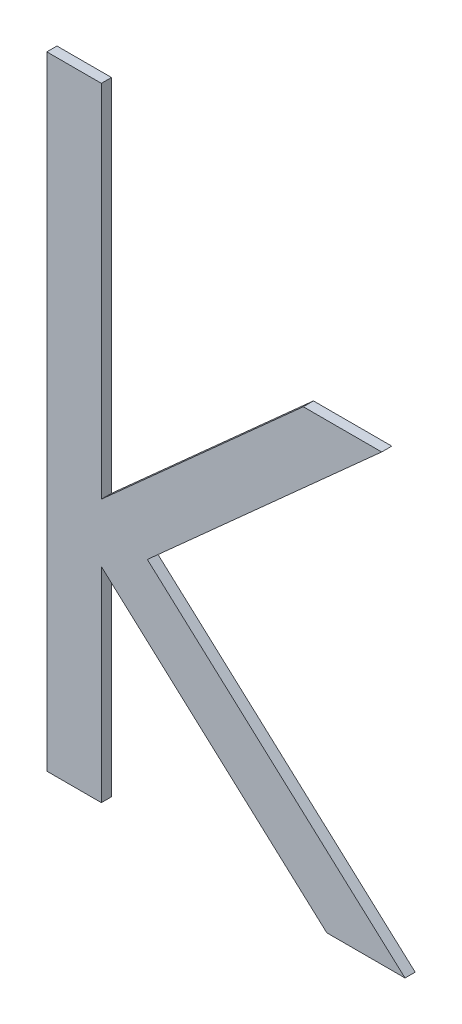
ISO-10303-21;
HEADER;
FILE_DESCRIPTION(('STEP AP214'),'2;1');
FILE_NAME('part.step','',(''),(''),'','','');
FILE_SCHEMA(('AUTOMOTIVE_DESIGN { 1 0 10303 214 1 1 1 1 }'));
ENDSEC;
DATA;
#1=APPLICATION_CONTEXT('core data for automotive mechanical design processes');
#2=APPLICATION_PROTOCOL_DEFINITION('international standard','automotive_design',2000,#1);
#3=PRODUCT_CONTEXT('',#1,'mechanical');
#4=PRODUCT('Part','Part','',(#3));
#5=PRODUCT_RELATED_PRODUCT_CATEGORY('part','',(#4));
#6=PRODUCT_DEFINITION_FORMATION('','',#4);
#7=PRODUCT_DEFINITION_CONTEXT('part definition',#1,'design');
#8=PRODUCT_DEFINITION('design','',#6,#7);
#9=PRODUCT_DEFINITION_SHAPE('','',#8);
#10=(LENGTH_UNIT() NAMED_UNIT(*) SI_UNIT(.MILLI.,.METRE.));
#11=(NAMED_UNIT(*) PLANE_ANGLE_UNIT() SI_UNIT($,.RADIAN.));
#12=(NAMED_UNIT(*) SI_UNIT($,.STERADIAN.) SOLID_ANGLE_UNIT());
#13=UNCERTAINTY_MEASURE_WITH_UNIT(LENGTH_MEASURE(1.E-05),#10,'distance_accuracy_value','');
#14=(GEOMETRIC_REPRESENTATION_CONTEXT(3) GLOBAL_UNCERTAINTY_ASSIGNED_CONTEXT((#13)) GLOBAL_UNIT_ASSIGNED_CONTEXT((#10,
#11,#12)) REPRESENTATION_CONTEXT('',''));
#15=CARTESIAN_POINT('',(0.,0.,0.));
#16=DIRECTION('',(0.,0.,1.));
#17=DIRECTION('',(1.,0.,0.));
#18=AXIS2_PLACEMENT_3D('',#15,#16,#17);
#19=CARTESIAN_POINT('',(0.539825518952301,1.00888395616039,0.551));
#20=DIRECTION('',(-1.,0.,0.));
#21=DIRECTION('',(0.,0.,1.));
#22=AXIS2_PLACEMENT_3D('',#19,#20,#21);
#23=PLANE('',#22);
#24=DIRECTION('',(0.,1.,0.));
#25=VECTOR('',#24,1.);
#26=CARTESIAN_POINT('',(0.539825518952301,1.00888395616039,0.55));
#27=LINE('',#26,#25);
#28=CARTESIAN_POINT('',(0.539825518952301,1.00888395616039,0.55));
#29=VERTEX_POINT('',#28);
#30=CARTESIAN_POINT('',(0.539825518952301,1.07042241769885,0.55));
#31=VERTEX_POINT('',#30);
#32=EDGE_CURVE('E11',#29,#31,#27,.T.);
#33=ORIENTED_EDGE('',*,*,#32,.F.);
#34=DIRECTION('',(0.,0.,-1.));
#35=VECTOR('',#34,1.);
#36=CARTESIAN_POINT('',(0.539825518952301,1.00888395616039,0.551));
#37=LINE('',#36,#35);
#38=CARTESIAN_POINT('',(0.539825518952301,1.00888395616039,0.551));
#39=VERTEX_POINT('',#38);
#40=EDGE_CURVE('E194',#39,#29,#37,.T.);
#41=ORIENTED_EDGE('',*,*,#40,.F.);
#42=DIRECTION('',(0.,1.,0.));
#43=VECTOR('',#42,1.);
#44=CARTESIAN_POINT('',(0.539825518952301,1.00888395616039,0.551));
#45=LINE('',#44,#43);
#46=CARTESIAN_POINT('',(0.539825518952301,1.07042241769885,0.551));
#47=VERTEX_POINT('',#46);
#48=EDGE_CURVE('E187',#39,#47,#45,.T.);
#49=ORIENTED_EDGE('',*,*,#48,.T.);
#50=DIRECTION('',(0.,-2.22044604925006E-13,-1.));
#51=VECTOR('',#50,1.);
#52=CARTESIAN_POINT('',(0.539825518952301,1.07042241769885,0.551));
#53=LINE('',#52,#51);
#54=EDGE_CURVE('E115',#47,#31,#53,.T.);
#55=ORIENTED_EDGE('',*,*,#54,.T.);
#56=EDGE_LOOP('',(#33,#41,#49,#55));
#57=FACE_BOUND('',#56,.T.);
#58=ADVANCED_FACE('F17',(#57),#23,.T.);
#59=CARTESIAN_POINT('',(0.545210134336916,1.00888395616039,0.551));
#60=DIRECTION('',(0.,-1.,0.));
#61=DIRECTION('',(0.,0.,-1.));
#62=AXIS2_PLACEMENT_3D('',#59,#60,#61);
#63=PLANE('',#62);
#64=DIRECTION('',(-1.,0.,0.));
#65=VECTOR('',#64,1.);
#66=CARTESIAN_POINT('',(0.545210134336916,1.00888395616039,0.55));
#67=LINE('',#66,#65);
#68=CARTESIAN_POINT('',(0.545210134336916,1.00888395616039,0.55));
#69=VERTEX_POINT('',#68);
#70=EDGE_CURVE('E24',#69,#29,#67,.T.);
#71=ORIENTED_EDGE('',*,*,#70,.F.);
#72=DIRECTION('',(0.,0.,-1.));
#73=VECTOR('',#72,1.);
#74=CARTESIAN_POINT('',(0.545210134336916,1.00888395616039,0.551));
#75=LINE('',#74,#73);
#76=CARTESIAN_POINT('',(0.545210134336916,1.00888395616039,0.551));
#77=VERTEX_POINT('',#76);
#78=EDGE_CURVE('E189',#77,#69,#75,.T.);
#79=ORIENTED_EDGE('',*,*,#78,.F.);
#80=DIRECTION('',(-1.,0.,0.));
#81=VECTOR('',#80,1.);
#82=CARTESIAN_POINT('',(0.545210134336916,1.00888395616039,0.551));
#83=LINE('',#82,#81);
#84=EDGE_CURVE('E178',#77,#39,#83,.T.);
#85=ORIENTED_EDGE('',*,*,#84,.T.);
#86=ORIENTED_EDGE('',*,*,#40,.T.);
#87=EDGE_LOOP('',(#71,#79,#85,#86));
#88=FACE_BOUND('',#87,.T.);
#89=ADVANCED_FACE('F205',(#88),#63,.T.);
#90=CARTESIAN_POINT('',(0.545210134336916,1.02908828308347,0.551));
#91=DIRECTION('',(1.,0.,0.));
#92=DIRECTION('',(0.,0.,-1.));
#93=AXIS2_PLACEMENT_3D('',#90,#91,#92);
#94=PLANE('',#93);
#95=DIRECTION('',(0.,-1.,0.));
#96=VECTOR('',#95,1.);
#97=CARTESIAN_POINT('',(0.545210134336916,1.02908828308347,0.55));
#98=LINE('',#97,#96);
#99=CARTESIAN_POINT('',(0.545210134336916,1.02908828308347,0.55));
#100=VERTEX_POINT('',#99);
#101=EDGE_CURVE('E191',#100,#69,#98,.T.);
#102=ORIENTED_EDGE('',*,*,#101,.F.);
#103=DIRECTION('',(0.,0.,-1.));
#104=VECTOR('',#103,1.);
#105=CARTESIAN_POINT('',(0.545210134336916,1.02908828308347,0.551));
#106=LINE('',#105,#104);
#107=CARTESIAN_POINT('',(0.545210134336916,1.02908828308347,0.551));
#108=VERTEX_POINT('',#107);
#109=EDGE_CURVE('E181',#108,#100,#106,.T.);
#110=ORIENTED_EDGE('',*,*,#109,.F.);
#111=DIRECTION('',(0.,-1.,0.));
#112=VECTOR('',#111,1.);
#113=CARTESIAN_POINT('',(0.545210134336916,1.02908828308347,0.551));
#114=LINE('',#113,#112);
#115=EDGE_CURVE('E168',#108,#77,#114,.T.);
#116=ORIENTED_EDGE('',*,*,#115,.T.);
#117=ORIENTED_EDGE('',*,*,#78,.T.);
#118=EDGE_LOOP('',(#102,#110,#116,#117));
#119=FACE_BOUND('',#118,.T.);
#120=ADVANCED_FACE('F198',(#119),#94,.T.);
#121=CARTESIAN_POINT('',(0.567481768952301,1.00888395616039,0.551));
#122=DIRECTION('',(-0.671896534985391,-0.740645020421137,0.));
#123=DIRECTION('',(0.740645020421137,-0.67189653498539,0.));
#124=AXIS2_PLACEMENT_3D('',#121,#122,#123);
#125=PLANE('',#124);
#126=DIRECTION('',(-0.740645020421134,0.671896534985394,0.));
#127=VECTOR('',#126,1.);
#128=CARTESIAN_POINT('',(0.567481768952301,1.00888395616039,0.55));
#129=LINE('',#128,#127);
#130=CARTESIAN_POINT('',(0.567481768952301,1.00888395616039,0.55));
#131=VERTEX_POINT('',#130);
#132=EDGE_CURVE('E184',#131,#100,#129,.T.);
#133=ORIENTED_EDGE('',*,*,#132,.F.);
#134=DIRECTION('',(-1.11022302462503E-13,0.,-1.));
#135=VECTOR('',#134,1.);
#136=CARTESIAN_POINT('',(0.567481768952301,1.00888395616039,0.551));
#137=LINE('',#136,#135);
#138=CARTESIAN_POINT('',(0.567481768952301,1.00888395616039,0.551));
#139=VERTEX_POINT('',#138);
#140=EDGE_CURVE('E171',#139,#131,#137,.T.);
#141=ORIENTED_EDGE('',*,*,#140,.F.);
#142=DIRECTION('',(-0.740645020421134,0.671896534985394,0.));
#143=VECTOR('',#142,1.);
#144=CARTESIAN_POINT('',(0.567481768952301,1.00888395616039,0.551));
#145=LINE('',#144,#143);
#146=EDGE_CURVE('E159',#139,#108,#145,.T.);
#147=ORIENTED_EDGE('',*,*,#146,.T.);
#148=ORIENTED_EDGE('',*,*,#109,.T.);
#149=EDGE_LOOP('',(#133,#141,#147,#148));
#150=FACE_BOUND('',#149,.T.);
#151=ADVANCED_FACE('F200',(#150),#125,.T.);
#152=CARTESIAN_POINT('',(0.575210134336916,1.00888395616039,0.551));
#153=DIRECTION('',(0.,-1.,0.));
#154=DIRECTION('',(0.,0.,-1.));
#155=AXIS2_PLACEMENT_3D('',#152,#153,#154);
#156=PLANE('',#155);
#157=DIRECTION('',(-1.,0.,0.));
#158=VECTOR('',#157,1.);
#159=CARTESIAN_POINT('',(0.575210134336916,1.00888395616039,0.55));
#160=LINE('',#159,#158);
#161=CARTESIAN_POINT('',(0.575210134336916,1.00888395616039,0.55));
#162=VERTEX_POINT('',#161);
#163=EDGE_CURVE('E174',#162,#131,#160,.T.);
#164=ORIENTED_EDGE('',*,*,#163,.F.);
#165=DIRECTION('',(0.,0.,-1.));
#166=VECTOR('',#165,1.);
#167=CARTESIAN_POINT('',(0.575210134336916,1.00888395616039,0.551));
#168=LINE('',#167,#166);
#169=CARTESIAN_POINT('',(0.575210134336916,1.00888395616039,0.551));
#170=VERTEX_POINT('',#169);
#171=EDGE_CURVE('E162',#170,#162,#168,.T.);
#172=ORIENTED_EDGE('',*,*,#171,.F.);
#173=DIRECTION('',(-1.,0.,0.));
#174=VECTOR('',#173,1.);
#175=CARTESIAN_POINT('',(0.575210134336916,1.00888395616039,0.551));
#176=LINE('',#175,#174);
#177=EDGE_CURVE('E150',#170,#139,#176,.T.);
#178=ORIENTED_EDGE('',*,*,#177,.T.);
#179=ORIENTED_EDGE('',*,*,#140,.T.);
#180=EDGE_LOOP('',(#164,#172,#178,#179));
#181=FACE_BOUND('',#180,.T.);
#182=ADVANCED_FACE('F217',(#181),#156,.T.);
#183=CARTESIAN_POINT('',(0.549753403567686,1.03196087923731,0.551));
#184=DIRECTION('',(0.671627454189112,0.740889035402369,0.));
#185=DIRECTION('',(-0.740889035402369,0.671627454189112,0.));
#186=AXIS2_PLACEMENT_3D('',#183,#184,#185);
#187=PLANE('',#186);
#188=DIRECTION('',(0.740889035402369,-0.671627454189112,0.));
#189=VECTOR('',#188,1.);
#190=CARTESIAN_POINT('',(0.549753403567686,1.03196087923731,0.55));
#191=LINE('',#190,#189);
#192=CARTESIAN_POINT('',(0.549753403567686,1.03196087923731,0.55));
#193=VERTEX_POINT('',#192);
#194=EDGE_CURVE('E165',#193,#162,#191,.T.);
#195=ORIENTED_EDGE('',*,*,#194,.F.);
#196=DIRECTION('',(0.,0.,-1.));
#197=VECTOR('',#196,1.);
#198=CARTESIAN_POINT('',(0.549753403567686,1.03196087923731,0.551));
#199=LINE('',#198,#197);
#200=CARTESIAN_POINT('',(0.549753403567686,1.03196087923731,0.551));
#201=VERTEX_POINT('',#200);
#202=EDGE_CURVE('E153',#201,#193,#199,.T.);
#203=ORIENTED_EDGE('',*,*,#202,.F.);
#204=DIRECTION('',(0.740889035402369,-0.671627454189112,0.));
#205=VECTOR('',#204,1.);
#206=CARTESIAN_POINT('',(0.549753403567686,1.03196087923731,0.551));
#207=LINE('',#206,#205);
#208=EDGE_CURVE('E141',#201,#170,#207,.T.);
#209=ORIENTED_EDGE('',*,*,#208,.T.);
#210=ORIENTED_EDGE('',*,*,#171,.T.);
#211=EDGE_LOOP('',(#195,#203,#209,#210));
#212=FACE_BOUND('',#211,.T.);
#213=ADVANCED_FACE('F215',(#212),#187,.T.);
#214=CARTESIAN_POINT('',(0.572902442029224,1.05273011000654,0.551));
#215=DIRECTION('',(0.667810938297981,-0.744330941644622,0.));
#216=DIRECTION('',(0.744330941644622,0.667810938297981,0.));
#217=AXIS2_PLACEMENT_3D('',#214,#215,#216);
#218=PLANE('',#217);
#219=DIRECTION('',(-0.744330941644626,-0.667810938297977,0.));
#220=VECTOR('',#219,1.);
#221=CARTESIAN_POINT('',(0.572902442029224,1.05273011000654,0.55));
#222=LINE('',#221,#220);
#223=CARTESIAN_POINT('',(0.572902442029224,1.05273011000654,0.55));
#224=VERTEX_POINT('',#223);
#225=EDGE_CURVE('E156',#224,#193,#222,.T.);
#226=ORIENTED_EDGE('',*,*,#225,.F.);
#227=DIRECTION('',(0.,0.,-1.));
#228=VECTOR('',#227,1.);
#229=CARTESIAN_POINT('',(0.572902442029224,1.05273011000654,0.551));
#230=LINE('',#229,#228);
#231=CARTESIAN_POINT('',(0.572902442029224,1.05273011000654,0.551));
#232=VERTEX_POINT('',#231);
#233=EDGE_CURVE('E144',#232,#224,#230,.T.);
#234=ORIENTED_EDGE('',*,*,#233,.F.);
#235=DIRECTION('',(-0.744330941644626,-0.667810938297977,0.));
#236=VECTOR('',#235,1.);
#237=CARTESIAN_POINT('',(0.572902442029224,1.05273011000654,0.551));
#238=LINE('',#237,#236);
#239=EDGE_CURVE('E132',#232,#201,#238,.T.);
#240=ORIENTED_EDGE('',*,*,#239,.T.);
#241=ORIENTED_EDGE('',*,*,#202,.T.);
#242=EDGE_LOOP('',(#226,#234,#240,#241));
#243=FACE_BOUND('',#242,.T.);
#244=ADVANCED_FACE('F212',(#243),#218,.T.);
#245=CARTESIAN_POINT('',(0.565162057413839,1.05273011000654,0.551));
#246=DIRECTION('',(0.,1.,0.));
#247=DIRECTION('',(0.,0.,1.));
#248=AXIS2_PLACEMENT_3D('',#245,#246,#247);
#249=PLANE('',#248);
#250=DIRECTION('',(1.,0.,0.));
#251=VECTOR('',#250,1.);
#252=CARTESIAN_POINT('',(0.565162057413839,1.05273011000654,0.55));
#253=LINE('',#252,#251);
#254=CARTESIAN_POINT('',(0.565162057413839,1.05273011000654,0.55));
#255=VERTEX_POINT('',#254);
#256=EDGE_CURVE('E147',#255,#224,#253,.T.);
#257=ORIENTED_EDGE('',*,*,#256,.F.);
#258=DIRECTION('',(0.,0.,-1.));
#259=VECTOR('',#258,1.);
#260=CARTESIAN_POINT('',(0.565162057413839,1.05273011000654,0.551));
#261=LINE('',#260,#259);
#262=CARTESIAN_POINT('',(0.565162057413839,1.05273011000654,0.551));
#263=VERTEX_POINT('',#262);
#264=EDGE_CURVE('E135',#263,#255,#261,.T.);
#265=ORIENTED_EDGE('',*,*,#264,.F.);
#266=DIRECTION('',(1.,0.,0.));
#267=VECTOR('',#266,1.);
#268=CARTESIAN_POINT('',(0.565162057413839,1.05273011000654,0.551));
#269=LINE('',#268,#267);
#270=EDGE_CURVE('E126',#263,#232,#269,.T.);
#271=ORIENTED_EDGE('',*,*,#270,.T.);
#272=ORIENTED_EDGE('',*,*,#233,.T.);
#273=EDGE_LOOP('',(#257,#265,#271,#272));
#274=FACE_BOUND('',#273,.T.);
#275=ADVANCED_FACE('F209',(#274),#249,.T.);
#276=CARTESIAN_POINT('',(0.545210134336916,1.03484549462193,0.551));
#277=DIRECTION('',(-0.667476411136923,0.744630942531784,0.));
#278=DIRECTION('',(-0.744630942531784,-0.667476411136923,0.));
#279=AXIS2_PLACEMENT_3D('',#276,#277,#278);
#280=PLANE('',#279);
#281=DIRECTION('',(0.744630942531781,0.667476411136927,0.));
#282=VECTOR('',#281,1.);
#283=CARTESIAN_POINT('',(0.545210134336916,1.03484549462193,0.55));
#284=LINE('',#283,#282);
#285=CARTESIAN_POINT('',(0.545210134336916,1.03484549462193,0.55));
#286=VERTEX_POINT('',#285);
#287=EDGE_CURVE('E138',#286,#255,#284,.T.);
#288=ORIENTED_EDGE('',*,*,#287,.F.);
#289=DIRECTION('',(0.,0.,-1.));
#290=VECTOR('',#289,1.);
#291=CARTESIAN_POINT('',(0.545210134336916,1.03484549462193,0.551));
#292=LINE('',#291,#290);
#293=CARTESIAN_POINT('',(0.545210134336916,1.03484549462193,0.551));
#294=VERTEX_POINT('',#293);
#295=EDGE_CURVE('E129',#294,#286,#292,.T.);
#296=ORIENTED_EDGE('',*,*,#295,.F.);
#297=DIRECTION('',(0.744630942531781,0.667476411136927,0.));
#298=VECTOR('',#297,1.);
#299=CARTESIAN_POINT('',(0.545210134336916,1.03484549462193,0.551));
#300=LINE('',#299,#298);
#301=EDGE_CURVE('E109',#294,#263,#300,.T.);
#302=ORIENTED_EDGE('',*,*,#301,.T.);
#303=ORIENTED_EDGE('',*,*,#264,.T.);
#304=EDGE_LOOP('',(#288,#296,#302,#303));
#305=FACE_BOUND('',#304,.T.);
#306=ADVANCED_FACE('F207',(#305),#280,.T.);
#307=CARTESIAN_POINT('',(0.545210134336916,1.07042241769885,0.551));
#308=DIRECTION('',(1.,0.,0.));
#309=DIRECTION('',(0.,0.,-1.));
#310=AXIS2_PLACEMENT_3D('',#307,#308,#309);
#311=PLANE('',#310);
#312=DIRECTION('',(0.,-1.,0.));
#313=VECTOR('',#312,1.);
#314=CARTESIAN_POINT('',(0.545210134336916,1.07042241769885,0.55));
#315=LINE('',#314,#313);
#316=CARTESIAN_POINT('',(0.545210134336916,1.07042241769885,0.55));
#317=VERTEX_POINT('',#316);
#318=EDGE_CURVE('E104',#317,#286,#315,.T.);
#319=ORIENTED_EDGE('',*,*,#318,.F.);
#320=DIRECTION('',(0.,-2.22044604925006E-13,-1.));
#321=VECTOR('',#320,1.);
#322=CARTESIAN_POINT('',(0.545210134336916,1.07042241769885,0.551));
#323=LINE('',#322,#321);
#324=CARTESIAN_POINT('',(0.545210134336916,1.07042241769885,0.551));
#325=VERTEX_POINT('',#324);
#326=EDGE_CURVE('E96',#325,#317,#323,.T.);
#327=ORIENTED_EDGE('',*,*,#326,.F.);
#328=DIRECTION('',(0.,-1.,0.));
#329=VECTOR('',#328,1.);
#330=CARTESIAN_POINT('',(0.545210134336916,1.07042241769885,0.551));
#331=LINE('',#330,#329);
#332=EDGE_CURVE('E101',#325,#294,#331,.T.);
#333=ORIENTED_EDGE('',*,*,#332,.T.);
#334=ORIENTED_EDGE('',*,*,#295,.T.);
#335=EDGE_LOOP('',(#319,#327,#333,#334));
#336=FACE_BOUND('',#335,.T.);
#337=ADVANCED_FACE('F98',(#336),#311,.T.);
#338=CARTESIAN_POINT('',(0.539825518952301,1.07042241769885,0.551));
#339=DIRECTION('',(0.,1.,0.));
#340=DIRECTION('',(0.,0.,1.));
#341=AXIS2_PLACEMENT_3D('',#338,#339,#340);
#342=PLANE('',#341);
#343=DIRECTION('',(1.,0.,0.));
#344=VECTOR('',#343,1.);
#345=CARTESIAN_POINT('',(0.539825518952301,1.07042241769885,0.55));
#346=LINE('',#345,#344);
#347=EDGE_CURVE('E108',#31,#317,#346,.T.);
#348=ORIENTED_EDGE('',*,*,#347,.F.);
#349=ORIENTED_EDGE('',*,*,#54,.F.);
#350=DIRECTION('',(1.,0.,0.));
#351=VECTOR('',#350,1.);
#352=CARTESIAN_POINT('',(0.539825518952301,1.07042241769885,0.551));
#353=LINE('',#352,#351);
#354=EDGE_CURVE('E113',#47,#325,#353,.T.);
#355=ORIENTED_EDGE('',*,*,#354,.T.);
#356=ORIENTED_EDGE('',*,*,#326,.T.);
#357=EDGE_LOOP('',(#348,#349,#355,#356));
#358=FACE_BOUND('',#357,.T.);
#359=ADVANCED_FACE('F114',(#358),#342,.T.);
#360=CARTESIAN_POINT('',(0.,0.,0.551));
#361=DIRECTION('',(0.,0.,-1.));
#362=DIRECTION('',(-1.,0.,0.));
#363=AXIS2_PLACEMENT_3D('',#360,#361,#362);
#364=PLANE('',#363);
#365=ORIENTED_EDGE('',*,*,#48,.F.);
#366=ORIENTED_EDGE('',*,*,#84,.F.);
#367=ORIENTED_EDGE('',*,*,#115,.F.);
#368=ORIENTED_EDGE('',*,*,#146,.F.);
#369=ORIENTED_EDGE('',*,*,#177,.F.);
#370=ORIENTED_EDGE('',*,*,#208,.F.);
#371=ORIENTED_EDGE('',*,*,#239,.F.);
#372=ORIENTED_EDGE('',*,*,#270,.F.);
#373=ORIENTED_EDGE('',*,*,#301,.F.);
#374=ORIENTED_EDGE('',*,*,#332,.F.);
#375=ORIENTED_EDGE('',*,*,#354,.F.);
#376=EDGE_LOOP('',(#365,#366,#367,#368,#369,#370,#371,#372,#373,#374,#375));
#377=FACE_BOUND('',#376,.T.);
#378=ADVANCED_FACE('F119',(#377),#364,.F.);
#379=CARTESIAN_POINT('',(0.,0.,0.55));
#380=DIRECTION('',(0.,0.,-1.));
#381=DIRECTION('',(-1.,0.,0.));
#382=AXIS2_PLACEMENT_3D('',#379,#380,#381);
#383=PLANE('',#382);
#384=ORIENTED_EDGE('',*,*,#32,.T.);
#385=ORIENTED_EDGE('',*,*,#347,.T.);
#386=ORIENTED_EDGE('',*,*,#318,.T.);
#387=ORIENTED_EDGE('',*,*,#287,.T.);
#388=ORIENTED_EDGE('',*,*,#256,.T.);
#389=ORIENTED_EDGE('',*,*,#225,.T.);
#390=ORIENTED_EDGE('',*,*,#194,.T.);
#391=ORIENTED_EDGE('',*,*,#163,.T.);
#392=ORIENTED_EDGE('',*,*,#132,.T.);
#393=ORIENTED_EDGE('',*,*,#101,.T.);
#394=ORIENTED_EDGE('',*,*,#70,.T.);
#395=EDGE_LOOP('',(#384,#385,#386,#387,#388,#389,#390,#391,#392,#393,#394));
#396=FACE_BOUND('',#395,.T.);
#397=ADVANCED_FACE('F196',(#396),#383,.T.);
#398=CLOSED_SHELL('',(#58,#89,#120,#151,#182,#213,#244,#275,#306,#337,#359,#378,#397));
#399=MANIFOLD_SOLID_BREP('B1',#398);
#400=ADVANCED_BREP_SHAPE_REPRESENTATION('',(#18,#399),#14);
#401=SHAPE_DEFINITION_REPRESENTATION(#9,#400);
ENDSEC;
END-ISO-10303-21;
